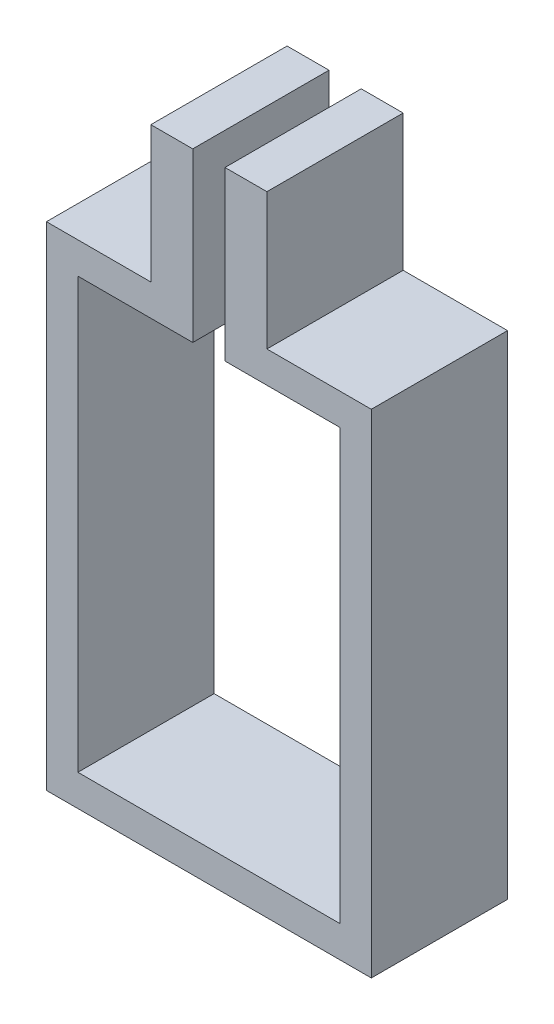
ISO-10303-21;
HEADER;
FILE_DESCRIPTION(('STEP AP214'),'2;1');
FILE_NAME('part.step','',(''),(''),'','','');
FILE_SCHEMA(('AUTOMOTIVE_DESIGN { 1 0 10303 214 1 1 1 1 }'));
ENDSEC;
DATA;
#1=APPLICATION_CONTEXT('core data for automotive mechanical design processes');
#2=APPLICATION_PROTOCOL_DEFINITION('international standard','automotive_design',2000,#1);
#3=PRODUCT_CONTEXT('',#1,'mechanical');
#4=PRODUCT('Part','Part','',(#3));
#5=PRODUCT_RELATED_PRODUCT_CATEGORY('part','',(#4));
#6=PRODUCT_DEFINITION_FORMATION('','',#4);
#7=PRODUCT_DEFINITION_CONTEXT('part definition',#1,'design');
#8=PRODUCT_DEFINITION('design','',#6,#7);
#9=PRODUCT_DEFINITION_SHAPE('','',#8);
#10=(LENGTH_UNIT() NAMED_UNIT(*) SI_UNIT(.MILLI.,.METRE.));
#11=(NAMED_UNIT(*) PLANE_ANGLE_UNIT() SI_UNIT($,.RADIAN.));
#12=(NAMED_UNIT(*) SI_UNIT($,.STERADIAN.) SOLID_ANGLE_UNIT());
#13=UNCERTAINTY_MEASURE_WITH_UNIT(LENGTH_MEASURE(1.E-05),#10,'distance_accuracy_value','');
#14=(GEOMETRIC_REPRESENTATION_CONTEXT(3) GLOBAL_UNCERTAINTY_ASSIGNED_CONTEXT((#13)) GLOBAL_UNIT_ASSIGNED_CONTEXT((#10,
#11,#12)) REPRESENTATION_CONTEXT('',''));
#15=CARTESIAN_POINT('',(0.,0.,0.));
#16=DIRECTION('',(0.,0.,1.));
#17=DIRECTION('',(1.,0.,0.));
#18=AXIS2_PLACEMENT_3D('',#15,#16,#17);
#19=CARTESIAN_POINT('',(-15.5,23.5,13.));
#20=DIRECTION('',(0.,-1.,0.));
#21=DIRECTION('',(0.,0.,-1.));
#22=AXIS2_PLACEMENT_3D('',#19,#20,#21);
#23=PLANE('',#22);
#24=DIRECTION('',(0.,0.,1.));
#25=VECTOR('',#24,1.);
#26=CARTESIAN_POINT('',(-5.53772432598043,23.5,13.));
#27=LINE('',#26,#25);
#28=CARTESIAN_POINT('',(-5.53772432598043,23.5,0.));
#29=VERTEX_POINT('',#28);
#30=CARTESIAN_POINT('',(-5.53772432598043,23.5,13.));
#31=VERTEX_POINT('',#30);
#32=EDGE_CURVE('E166',#29,#31,#27,.T.);
#33=ORIENTED_EDGE('',*,*,#32,.F.);
#34=DIRECTION('',(-1.,0.,0.));
#35=VECTOR('',#34,1.);
#36=CARTESIAN_POINT('',(-15.5,23.5,0.));
#37=LINE('',#36,#35);
#38=CARTESIAN_POINT('',(-15.5,23.5,0.));
#39=VERTEX_POINT('',#38);
#40=EDGE_CURVE('E246',#29,#39,#37,.T.);
#41=ORIENTED_EDGE('',*,*,#40,.T.);
#42=DIRECTION('',(0.,0.,-1.));
#43=VECTOR('',#42,1.);
#44=CARTESIAN_POINT('',(-15.5,23.5,13.));
#45=LINE('',#44,#43);
#46=CARTESIAN_POINT('',(-15.5,23.5,13.));
#47=VERTEX_POINT('',#46);
#48=EDGE_CURVE('E258',#47,#39,#45,.T.);
#49=ORIENTED_EDGE('',*,*,#48,.F.);
#50=DIRECTION('',(-1.,0.,0.));
#51=VECTOR('',#50,1.);
#52=CARTESIAN_POINT('',(-15.5,23.5,13.));
#53=LINE('',#52,#51);
#54=EDGE_CURVE('E234',#31,#47,#53,.T.);
#55=ORIENTED_EDGE('',*,*,#54,.F.);
#56=EDGE_LOOP('',(#33,#41,#49,#55));
#57=FACE_BOUND('',#56,.T.);
#58=ADVANCED_FACE('F33',(#57),#23,.F.);
#59=DIRECTION('',(0.,0.,-1.));
#60=VECTOR('',#59,1.);
#61=CARTESIAN_POINT('',(5.53772432598043,23.5,13.));
#62=LINE('',#61,#60);
#63=CARTESIAN_POINT('',(5.53772432598043,23.5,13.));
#64=VERTEX_POINT('',#63);
#65=CARTESIAN_POINT('',(5.53772432598043,23.5,0.));
#66=VERTEX_POINT('',#65);
#67=EDGE_CURVE('E176',#64,#66,#62,.T.);
#68=ORIENTED_EDGE('',*,*,#67,.F.);
#69=CARTESIAN_POINT('',(15.5,23.5,13.));
#70=VERTEX_POINT('',#69);
#71=EDGE_CURVE('E236',#70,#64,#53,.T.);
#72=ORIENTED_EDGE('',*,*,#71,.F.);
#73=DIRECTION('',(0.,0.,-1.));
#74=VECTOR('',#73,1.);
#75=CARTESIAN_POINT('',(15.5,23.5,13.));
#76=LINE('',#75,#74);
#77=CARTESIAN_POINT('',(15.5,23.5,0.));
#78=VERTEX_POINT('',#77);
#79=EDGE_CURVE('E261',#70,#78,#76,.T.);
#80=ORIENTED_EDGE('',*,*,#79,.T.);
#81=EDGE_CURVE('E247',#78,#66,#37,.T.);
#82=ORIENTED_EDGE('',*,*,#81,.T.);
#83=EDGE_LOOP('',(#68,#72,#80,#82));
#84=FACE_BOUND('',#83,.T.);
#85=ADVANCED_FACE('F299',(#84),#23,.F.);
#86=CARTESIAN_POINT('',(-12.5,20.5,0.));
#87=DIRECTION('',(0.,1.,0.));
#88=DIRECTION('',(0.,0.,1.));
#89=AXIS2_PLACEMENT_3D('',#86,#87,#88);
#90=PLANE('',#89);
#91=DIRECTION('',(-1.,0.,0.));
#92=VECTOR('',#91,1.);
#93=CARTESIAN_POINT('',(-12.5,20.5,13.));
#94=LINE('',#93,#92);
#95=CARTESIAN_POINT('',(12.5,20.5,13.));
#96=VERTEX_POINT('',#95);
#97=CARTESIAN_POINT('',(1.53772432598043,20.5,13.));
#98=VERTEX_POINT('',#97);
#99=EDGE_CURVE('E213',#96,#98,#94,.T.);
#100=ORIENTED_EDGE('',*,*,#99,.T.);
#101=DIRECTION('',(0.,0.,-1.));
#102=VECTOR('',#101,1.);
#103=CARTESIAN_POINT('',(1.53772432598043,20.5,0.));
#104=LINE('',#103,#102);
#105=CARTESIAN_POINT('',(1.53772432598043,20.5,0.));
#106=VERTEX_POINT('',#105);
#107=EDGE_CURVE('E11',#98,#106,#104,.T.);
#108=ORIENTED_EDGE('',*,*,#107,.T.);
#109=DIRECTION('',(-1.,0.,0.));
#110=VECTOR('',#109,1.);
#111=CARTESIAN_POINT('',(-12.5,20.5,0.));
#112=LINE('',#111,#110);
#113=CARTESIAN_POINT('',(12.5,20.5,0.));
#114=VERTEX_POINT('',#113);
#115=EDGE_CURVE('E202',#114,#106,#112,.T.);
#116=ORIENTED_EDGE('',*,*,#115,.F.);
#117=DIRECTION('',(0.,0.,1.));
#118=VECTOR('',#117,1.);
#119=CARTESIAN_POINT('',(12.5,20.5,0.));
#120=LINE('',#119,#118);
#121=EDGE_CURVE('E210',#114,#96,#120,.T.);
#122=ORIENTED_EDGE('',*,*,#121,.T.);
#123=EDGE_LOOP('',(#100,#108,#116,#122));
#124=FACE_BOUND('',#123,.T.);
#125=ADVANCED_FACE('F285',(#124),#90,.F.);
#126=CARTESIAN_POINT('',(15.5,23.5,13.));
#127=DIRECTION('',(-1.,0.,0.));
#128=DIRECTION('',(0.,-1.,0.));
#129=AXIS2_PLACEMENT_3D('',#126,#127,#128);
#130=PLANE('',#129);
#131=DIRECTION('',(0.,1.,0.));
#132=VECTOR('',#131,1.);
#133=CARTESIAN_POINT('',(15.5,23.5,0.));
#134=LINE('',#133,#132);
#135=CARTESIAN_POINT('',(15.5,-23.5,0.));
#136=VERTEX_POINT('',#135);
#137=EDGE_CURVE('E223',#136,#78,#134,.T.);
#138=ORIENTED_EDGE('',*,*,#137,.T.);
#139=ORIENTED_EDGE('',*,*,#79,.F.);
#140=DIRECTION('',(0.,1.,0.));
#141=VECTOR('',#140,1.);
#142=CARTESIAN_POINT('',(15.5,23.5,13.));
#143=LINE('',#142,#141);
#144=CARTESIAN_POINT('',(15.5,-23.5,13.));
#145=VERTEX_POINT('',#144);
#146=EDGE_CURVE('E231',#145,#70,#143,.T.);
#147=ORIENTED_EDGE('',*,*,#146,.F.);
#148=DIRECTION('',(0.,0.,-1.));
#149=VECTOR('',#148,1.);
#150=CARTESIAN_POINT('',(15.5,-23.5,13.));
#151=LINE('',#150,#149);
#152=EDGE_CURVE('E243',#145,#136,#151,.T.);
#153=ORIENTED_EDGE('',*,*,#152,.T.);
#154=EDGE_LOOP('',(#138,#139,#147,#153));
#155=FACE_BOUND('',#154,.T.);
#156=ADVANCED_FACE('F35',(#155),#130,.F.);
#157=CARTESIAN_POINT('',(-15.5,23.5,13.));
#158=DIRECTION('',(1.,0.,0.));
#159=DIRECTION('',(0.,1.,0.));
#160=AXIS2_PLACEMENT_3D('',#157,#158,#159);
#161=PLANE('',#160);
#162=DIRECTION('',(0.,-1.,0.));
#163=VECTOR('',#162,1.);
#164=CARTESIAN_POINT('',(-15.5,23.5,0.));
#165=LINE('',#164,#163);
#166=CARTESIAN_POINT('',(-15.5,-23.5,0.));
#167=VERTEX_POINT('',#166);
#168=EDGE_CURVE('E250',#39,#167,#165,.T.);
#169=ORIENTED_EDGE('',*,*,#168,.T.);
#170=DIRECTION('',(0.,0.,-1.));
#171=VECTOR('',#170,1.);
#172=CARTESIAN_POINT('',(-15.5,-23.5,13.));
#173=LINE('',#172,#171);
#174=CARTESIAN_POINT('',(-15.5,-23.5,13.));
#175=VERTEX_POINT('',#174);
#176=EDGE_CURVE('E255',#175,#167,#173,.T.);
#177=ORIENTED_EDGE('',*,*,#176,.F.);
#178=DIRECTION('',(0.,-1.,0.));
#179=VECTOR('',#178,1.);
#180=CARTESIAN_POINT('',(-15.5,23.5,13.));
#181=LINE('',#180,#179);
#182=EDGE_CURVE('E239',#47,#175,#181,.T.);
#183=ORIENTED_EDGE('',*,*,#182,.F.);
#184=ORIENTED_EDGE('',*,*,#48,.T.);
#185=EDGE_LOOP('',(#169,#177,#183,#184));
#186=FACE_BOUND('',#185,.T.);
#187=ADVANCED_FACE('F312',(#186),#161,.F.);
#188=CARTESIAN_POINT('',(-15.5,-23.5,13.));
#189=DIRECTION('',(0.,1.,0.));
#190=DIRECTION('',(0.,0.,1.));
#191=AXIS2_PLACEMENT_3D('',#188,#189,#190);
#192=PLANE('',#191);
#193=DIRECTION('',(1.,0.,0.));
#194=VECTOR('',#193,1.);
#195=CARTESIAN_POINT('',(-15.5,-23.5,0.));
#196=LINE('',#195,#194);
#197=EDGE_CURVE('E235',#167,#136,#196,.T.);
#198=ORIENTED_EDGE('',*,*,#197,.T.);
#199=ORIENTED_EDGE('',*,*,#152,.F.);
#200=DIRECTION('',(1.,0.,0.));
#201=VECTOR('',#200,1.);
#202=CARTESIAN_POINT('',(-15.5,-23.5,13.));
#203=LINE('',#202,#201);
#204=EDGE_CURVE('E241',#175,#145,#203,.T.);
#205=ORIENTED_EDGE('',*,*,#204,.F.);
#206=ORIENTED_EDGE('',*,*,#176,.T.);
#207=EDGE_LOOP('',(#198,#199,#205,#206));
#208=FACE_BOUND('',#207,.T.);
#209=ADVANCED_FACE('F307',(#208),#192,.F.);
#210=CARTESIAN_POINT('',(0.,0.,13.));
#211=DIRECTION('',(0.,0.,1.));
#212=DIRECTION('',(1.,0.,0.));
#213=AXIS2_PLACEMENT_3D('',#210,#211,#212);
#214=PLANE('',#213);
#215=DIRECTION('',(0.,1.,0.));
#216=VECTOR('',#215,1.);
#217=CARTESIAN_POINT('',(1.53772432598043,0.,13.));
#218=LINE('',#217,#216);
#219=CARTESIAN_POINT('',(1.53772432598043,36.5,13.));
#220=VERTEX_POINT('',#219);
#221=EDGE_CURVE('E194',#98,#220,#218,.T.);
#222=ORIENTED_EDGE('',*,*,#221,.F.);
#223=ORIENTED_EDGE('',*,*,#99,.F.);
#224=DIRECTION('',(0.,1.,0.));
#225=VECTOR('',#224,1.);
#226=CARTESIAN_POINT('',(12.5,20.5,13.));
#227=LINE('',#226,#225);
#228=CARTESIAN_POINT('',(12.5,-20.5,13.));
#229=VERTEX_POINT('',#228);
#230=EDGE_CURVE('E196',#229,#96,#227,.T.);
#231=ORIENTED_EDGE('',*,*,#230,.F.);
#232=DIRECTION('',(1.,0.,0.));
#233=VECTOR('',#232,1.);
#234=CARTESIAN_POINT('',(-12.5,-20.5,13.));
#235=LINE('',#234,#233);
#236=CARTESIAN_POINT('',(-12.5,-20.5,13.));
#237=VERTEX_POINT('',#236);
#238=EDGE_CURVE('E201',#237,#229,#235,.T.);
#239=ORIENTED_EDGE('',*,*,#238,.F.);
#240=DIRECTION('',(0.,-1.,0.));
#241=VECTOR('',#240,1.);
#242=CARTESIAN_POINT('',(-12.5,20.5,13.));
#243=LINE('',#242,#241);
#244=CARTESIAN_POINT('',(-12.5,20.5,13.));
#245=VERTEX_POINT('',#244);
#246=EDGE_CURVE('E216',#245,#237,#243,.T.);
#247=ORIENTED_EDGE('',*,*,#246,.F.);
#248=CARTESIAN_POINT('',(-1.53772432598043,20.5,13.));
#249=VERTEX_POINT('',#248);
#250=EDGE_CURVE('E212',#249,#245,#94,.T.);
#251=ORIENTED_EDGE('',*,*,#250,.F.);
#252=DIRECTION('',(0.,-1.,0.));
#253=VECTOR('',#252,1.);
#254=CARTESIAN_POINT('',(-1.53772432598043,0.,13.));
#255=LINE('',#254,#253);
#256=CARTESIAN_POINT('',(-1.53772432598043,36.5,13.));
#257=VERTEX_POINT('',#256);
#258=EDGE_CURVE('E55',#257,#249,#255,.T.);
#259=ORIENTED_EDGE('',*,*,#258,.F.);
#260=DIRECTION('',(1.,0.,0.));
#261=VECTOR('',#260,1.);
#262=CARTESIAN_POINT('',(-1.53772432598043,36.5,13.));
#263=LINE('',#262,#261);
#264=CARTESIAN_POINT('',(-5.53772432598043,36.5,13.));
#265=VERTEX_POINT('',#264);
#266=EDGE_CURVE('E165',#265,#257,#263,.T.);
#267=ORIENTED_EDGE('',*,*,#266,.F.);
#268=DIRECTION('',(0.,-1.,0.));
#269=VECTOR('',#268,1.);
#270=CARTESIAN_POINT('',(-5.53772432598043,36.5,13.));
#271=LINE('',#270,#269);
#272=EDGE_CURVE('E171',#265,#31,#271,.T.);
#273=ORIENTED_EDGE('',*,*,#272,.T.);
#274=ORIENTED_EDGE('',*,*,#54,.T.);
#275=ORIENTED_EDGE('',*,*,#182,.T.);
#276=ORIENTED_EDGE('',*,*,#204,.T.);
#277=ORIENTED_EDGE('',*,*,#146,.T.);
#278=ORIENTED_EDGE('',*,*,#71,.T.);
#279=DIRECTION('',(0.,-1.,0.));
#280=VECTOR('',#279,1.);
#281=CARTESIAN_POINT('',(5.53772432598043,36.5,13.));
#282=LINE('',#281,#280);
#283=CARTESIAN_POINT('',(5.53772432598043,36.5,13.));
#284=VERTEX_POINT('',#283);
#285=EDGE_CURVE('E150',#284,#64,#282,.T.);
#286=ORIENTED_EDGE('',*,*,#285,.F.);
#287=DIRECTION('',(1.,0.,0.));
#288=VECTOR('',#287,1.);
#289=CARTESIAN_POINT('',(1.53772432598043,36.5,13.));
#290=LINE('',#289,#288);
#291=EDGE_CURVE('E180',#220,#284,#290,.T.);
#292=ORIENTED_EDGE('',*,*,#291,.F.);
#293=EDGE_LOOP('',(#222,#223,#231,#239,#247,#251,#259,#267,#273,#274,#275,#276,#277,#278,#286,#292));
#294=FACE_BOUND('',#293,.T.);
#295=ADVANCED_FACE('F270',(#294),#214,.T.);
#296=CARTESIAN_POINT('',(0.,0.,0.));
#297=DIRECTION('',(0.,0.,1.));
#298=DIRECTION('',(1.,0.,0.));
#299=AXIS2_PLACEMENT_3D('',#296,#297,#298);
#300=PLANE('',#299);
#301=ORIENTED_EDGE('',*,*,#115,.T.);
#302=DIRECTION('',(0.,1.,0.));
#303=VECTOR('',#302,1.);
#304=CARTESIAN_POINT('',(1.53772432598043,0.,0.));
#305=LINE('',#304,#303);
#306=CARTESIAN_POINT('',(1.53772432598043,36.5,0.));
#307=VERTEX_POINT('',#306);
#308=EDGE_CURVE('E48',#106,#307,#305,.T.);
#309=ORIENTED_EDGE('',*,*,#308,.T.);
#310=DIRECTION('',(-1.,0.,0.));
#311=VECTOR('',#310,1.);
#312=CARTESIAN_POINT('',(1.53772432598043,36.5,0.));
#313=LINE('',#312,#311);
#314=CARTESIAN_POINT('',(5.53772432598043,36.5,0.));
#315=VERTEX_POINT('',#314);
#316=EDGE_CURVE('E184',#315,#307,#313,.T.);
#317=ORIENTED_EDGE('',*,*,#316,.F.);
#318=DIRECTION('',(0.,-1.,0.));
#319=VECTOR('',#318,1.);
#320=CARTESIAN_POINT('',(5.53772432598043,36.5,0.));
#321=LINE('',#320,#319);
#322=EDGE_CURVE('E187',#315,#66,#321,.T.);
#323=ORIENTED_EDGE('',*,*,#322,.T.);
#324=ORIENTED_EDGE('',*,*,#81,.F.);
#325=ORIENTED_EDGE('',*,*,#137,.F.);
#326=ORIENTED_EDGE('',*,*,#197,.F.);
#327=ORIENTED_EDGE('',*,*,#168,.F.);
#328=ORIENTED_EDGE('',*,*,#40,.F.);
#329=DIRECTION('',(0.,-1.,0.));
#330=VECTOR('',#329,1.);
#331=CARTESIAN_POINT('',(-5.53772432598043,36.5,0.));
#332=LINE('',#331,#330);
#333=CARTESIAN_POINT('',(-5.53772432598043,36.5,0.));
#334=VERTEX_POINT('',#333);
#335=EDGE_CURVE('E157',#334,#29,#332,.T.);
#336=ORIENTED_EDGE('',*,*,#335,.F.);
#337=DIRECTION('',(-1.,0.,0.));
#338=VECTOR('',#337,1.);
#339=CARTESIAN_POINT('',(-1.53772432598043,36.5,0.));
#340=LINE('',#339,#338);
#341=CARTESIAN_POINT('',(-1.53772432598043,36.5,0.));
#342=VERTEX_POINT('',#341);
#343=EDGE_CURVE('E153',#342,#334,#340,.T.);
#344=ORIENTED_EDGE('',*,*,#343,.F.);
#345=DIRECTION('',(0.,-1.,0.));
#346=VECTOR('',#345,1.);
#347=CARTESIAN_POINT('',(-1.53772432598043,0.,0.));
#348=LINE('',#347,#346);
#349=CARTESIAN_POINT('',(-1.53772432598043,20.5,0.));
#350=VERTEX_POINT('',#349);
#351=EDGE_CURVE('E143',#342,#350,#348,.T.);
#352=ORIENTED_EDGE('',*,*,#351,.T.);
#353=CARTESIAN_POINT('',(-12.5,20.5,0.));
#354=VERTEX_POINT('',#353);
#355=EDGE_CURVE('E200',#350,#354,#112,.T.);
#356=ORIENTED_EDGE('',*,*,#355,.T.);
#357=DIRECTION('',(0.,-1.,0.));
#358=VECTOR('',#357,1.);
#359=CARTESIAN_POINT('',(-12.5,20.5,0.));
#360=LINE('',#359,#358);
#361=CARTESIAN_POINT('',(-12.5,-20.5,0.));
#362=VERTEX_POINT('',#361);
#363=EDGE_CURVE('E204',#354,#362,#360,.T.);
#364=ORIENTED_EDGE('',*,*,#363,.T.);
#365=DIRECTION('',(1.,0.,0.));
#366=VECTOR('',#365,1.);
#367=CARTESIAN_POINT('',(-12.5,-20.5,0.));
#368=LINE('',#367,#366);
#369=CARTESIAN_POINT('',(12.5,-20.5,0.));
#370=VERTEX_POINT('',#369);
#371=EDGE_CURVE('E207',#362,#370,#368,.T.);
#372=ORIENTED_EDGE('',*,*,#371,.T.);
#373=DIRECTION('',(0.,1.,0.));
#374=VECTOR('',#373,1.);
#375=CARTESIAN_POINT('',(12.5,20.5,0.));
#376=LINE('',#375,#374);
#377=EDGE_CURVE('E197',#370,#114,#376,.T.);
#378=ORIENTED_EDGE('',*,*,#377,.T.);
#379=EDGE_LOOP('',(#301,#309,#317,#323,#324,#325,#326,#327,#328,#336,#344,#352,#356,#364,#372,#378));
#380=FACE_BOUND('',#379,.T.);
#381=ADVANCED_FACE('F155',(#380),#300,.F.);
#382=CARTESIAN_POINT('',(12.5,20.5,0.));
#383=DIRECTION('',(1.,0.,0.));
#384=DIRECTION('',(0.,1.,0.));
#385=AXIS2_PLACEMENT_3D('',#382,#383,#384);
#386=PLANE('',#385);
#387=ORIENTED_EDGE('',*,*,#230,.T.);
#388=ORIENTED_EDGE('',*,*,#121,.F.);
#389=ORIENTED_EDGE('',*,*,#377,.F.);
#390=DIRECTION('',(0.,0.,1.));
#391=VECTOR('',#390,1.);
#392=CARTESIAN_POINT('',(12.5,-20.5,0.));
#393=LINE('',#392,#391);
#394=EDGE_CURVE('E221',#370,#229,#393,.T.);
#395=ORIENTED_EDGE('',*,*,#394,.T.);
#396=EDGE_LOOP('',(#387,#388,#389,#395));
#397=FACE_BOUND('',#396,.T.);
#398=ADVANCED_FACE('F281',(#397),#386,.F.);
#399=CARTESIAN_POINT('',(-12.5,-20.5,0.));
#400=DIRECTION('',(0.,-1.,0.));
#401=DIRECTION('',(0.,0.,-1.));
#402=AXIS2_PLACEMENT_3D('',#399,#400,#401);
#403=PLANE('',#402);
#404=ORIENTED_EDGE('',*,*,#238,.T.);
#405=ORIENTED_EDGE('',*,*,#394,.F.);
#406=ORIENTED_EDGE('',*,*,#371,.F.);
#407=DIRECTION('',(0.,0.,1.));
#408=VECTOR('',#407,1.);
#409=CARTESIAN_POINT('',(-12.5,-20.5,0.));
#410=LINE('',#409,#408);
#411=EDGE_CURVE('E224',#362,#237,#410,.T.);
#412=ORIENTED_EDGE('',*,*,#411,.T.);
#413=EDGE_LOOP('',(#404,#405,#406,#412));
#414=FACE_BOUND('',#413,.T.);
#415=ADVANCED_FACE('F279',(#414),#403,.F.);
#416=CARTESIAN_POINT('',(-12.5,20.5,0.));
#417=DIRECTION('',(-1.,0.,0.));
#418=DIRECTION('',(0.,-1.,0.));
#419=AXIS2_PLACEMENT_3D('',#416,#417,#418);
#420=PLANE('',#419);
#421=ORIENTED_EDGE('',*,*,#246,.T.);
#422=ORIENTED_EDGE('',*,*,#411,.F.);
#423=ORIENTED_EDGE('',*,*,#363,.F.);
#424=DIRECTION('',(0.,0.,1.));
#425=VECTOR('',#424,1.);
#426=CARTESIAN_POINT('',(-12.5,20.5,0.));
#427=LINE('',#426,#425);
#428=EDGE_CURVE('E226',#354,#245,#427,.T.);
#429=ORIENTED_EDGE('',*,*,#428,.T.);
#430=EDGE_LOOP('',(#421,#422,#423,#429));
#431=FACE_BOUND('',#430,.T.);
#432=ADVANCED_FACE('F274',(#431),#420,.F.);
#433=ORIENTED_EDGE('',*,*,#355,.F.);
#434=DIRECTION('',(0.,0.,1.));
#435=VECTOR('',#434,1.);
#436=CARTESIAN_POINT('',(-1.53772432598043,20.5,0.));
#437=LINE('',#436,#435);
#438=EDGE_CURVE('E41',#350,#249,#437,.T.);
#439=ORIENTED_EDGE('',*,*,#438,.T.);
#440=ORIENTED_EDGE('',*,*,#250,.T.);
#441=ORIENTED_EDGE('',*,*,#428,.F.);
#442=EDGE_LOOP('',(#433,#439,#440,#441));
#443=FACE_BOUND('',#442,.T.);
#444=ADVANCED_FACE('F265',(#443),#90,.F.);
#445=CARTESIAN_POINT('',(-1.53772432598043,10.5,-10.854192501597));
#446=DIRECTION('',(-1.,0.,0.));
#447=DIRECTION('',(0.,0.,1.));
#448=AXIS2_PLACEMENT_3D('',#445,#446,#447);
#449=PLANE('',#448);
#450=ORIENTED_EDGE('',*,*,#258,.T.);
#451=ORIENTED_EDGE('',*,*,#438,.F.);
#452=ORIENTED_EDGE('',*,*,#351,.F.);
#453=DIRECTION('',(0.,0.,-1.));
#454=VECTOR('',#453,1.);
#455=CARTESIAN_POINT('',(-1.53772432598043,36.5,13.));
#456=LINE('',#455,#454);
#457=EDGE_CURVE('E147',#257,#342,#456,.T.);
#458=ORIENTED_EDGE('',*,*,#457,.F.);
#459=EDGE_LOOP('',(#450,#451,#452,#458));
#460=FACE_BOUND('',#459,.T.);
#461=ADVANCED_FACE('F145',(#460),#449,.F.);
#462=CARTESIAN_POINT('',(1.53772432598043,10.5,-10.854192501597));
#463=DIRECTION('',(1.,0.,0.));
#464=DIRECTION('',(0.,0.,-1.));
#465=AXIS2_PLACEMENT_3D('',#462,#463,#464);
#466=PLANE('',#465);
#467=ORIENTED_EDGE('',*,*,#221,.T.);
#468=DIRECTION('',(0.,0.,1.));
#469=VECTOR('',#468,1.);
#470=CARTESIAN_POINT('',(1.53772432598043,36.5,13.));
#471=LINE('',#470,#469);
#472=EDGE_CURVE('E177',#307,#220,#471,.T.);
#473=ORIENTED_EDGE('',*,*,#472,.F.);
#474=ORIENTED_EDGE('',*,*,#308,.F.);
#475=ORIENTED_EDGE('',*,*,#107,.F.);
#476=EDGE_LOOP('',(#467,#473,#474,#475));
#477=FACE_BOUND('',#476,.T.);
#478=ADVANCED_FACE('F291',(#477),#466,.F.);
#479=CARTESIAN_POINT('',(5.53772432598043,36.5,13.));
#480=DIRECTION('',(-1.,0.,0.));
#481=DIRECTION('',(0.,0.,1.));
#482=AXIS2_PLACEMENT_3D('',#479,#480,#481);
#483=PLANE('',#482);
#484=ORIENTED_EDGE('',*,*,#67,.T.);
#485=ORIENTED_EDGE('',*,*,#322,.F.);
#486=DIRECTION('',(0.,0.,-1.));
#487=VECTOR('',#486,1.);
#488=CARTESIAN_POINT('',(5.53772432598043,36.5,13.));
#489=LINE('',#488,#487);
#490=EDGE_CURVE('E182',#284,#315,#489,.T.);
#491=ORIENTED_EDGE('',*,*,#490,.F.);
#492=ORIENTED_EDGE('',*,*,#285,.T.);
#493=EDGE_LOOP('',(#484,#485,#491,#492));
#494=FACE_BOUND('',#493,.T.);
#495=ADVANCED_FACE('F296',(#494),#483,.F.);
#496=CARTESIAN_POINT('',(0.,36.5,0.));
#497=DIRECTION('',(0.,-1.,0.));
#498=DIRECTION('',(0.,0.,-1.));
#499=AXIS2_PLACEMENT_3D('',#496,#497,#498);
#500=PLANE('',#499);
#501=ORIENTED_EDGE('',*,*,#472,.T.);
#502=ORIENTED_EDGE('',*,*,#291,.T.);
#503=ORIENTED_EDGE('',*,*,#490,.T.);
#504=ORIENTED_EDGE('',*,*,#316,.T.);
#505=EDGE_LOOP('',(#501,#502,#503,#504));
#506=FACE_BOUND('',#505,.T.);
#507=ADVANCED_FACE('F288',(#506),#500,.F.);
#508=CARTESIAN_POINT('',(-5.53772432598043,36.5,13.));
#509=DIRECTION('',(1.,0.,0.));
#510=DIRECTION('',(0.,0.,-1.));
#511=AXIS2_PLACEMENT_3D('',#508,#509,#510);
#512=PLANE('',#511);
#513=ORIENTED_EDGE('',*,*,#32,.T.);
#514=ORIENTED_EDGE('',*,*,#272,.F.);
#515=DIRECTION('',(0.,0.,1.));
#516=VECTOR('',#515,1.);
#517=CARTESIAN_POINT('',(-5.53772432598043,36.5,13.));
#518=LINE('',#517,#516);
#519=EDGE_CURVE('E160',#334,#265,#518,.T.);
#520=ORIENTED_EDGE('',*,*,#519,.F.);
#521=ORIENTED_EDGE('',*,*,#335,.T.);
#522=EDGE_LOOP('',(#513,#514,#520,#521));
#523=FACE_BOUND('',#522,.T.);
#524=ADVANCED_FACE('F319',(#523),#512,.F.);
#525=CARTESIAN_POINT('',(0.,36.5,0.));
#526=DIRECTION('',(0.,1.,0.));
#527=DIRECTION('',(0.,0.,1.));
#528=AXIS2_PLACEMENT_3D('',#525,#526,#527);
#529=PLANE('',#528);
#530=ORIENTED_EDGE('',*,*,#457,.T.);
#531=ORIENTED_EDGE('',*,*,#343,.T.);
#532=ORIENTED_EDGE('',*,*,#519,.T.);
#533=ORIENTED_EDGE('',*,*,#266,.T.);
#534=EDGE_LOOP('',(#530,#531,#532,#533));
#535=FACE_BOUND('',#534,.T.);
#536=ADVANCED_FACE('F163',(#535),#529,.T.);
#537=CLOSED_SHELL('',(#58,#85,#125,#156,#187,#209,#295,#381,#398,#415,#432,#444,#461,#478,#495,
#507,#524,#536));
#538=MANIFOLD_SOLID_BREP('B2',#537);
#539=ADVANCED_BREP_SHAPE_REPRESENTATION('',(#18,#538),#14);
#540=SHAPE_DEFINITION_REPRESENTATION(#9,#539);
ENDSEC;
END-ISO-10303-21;
